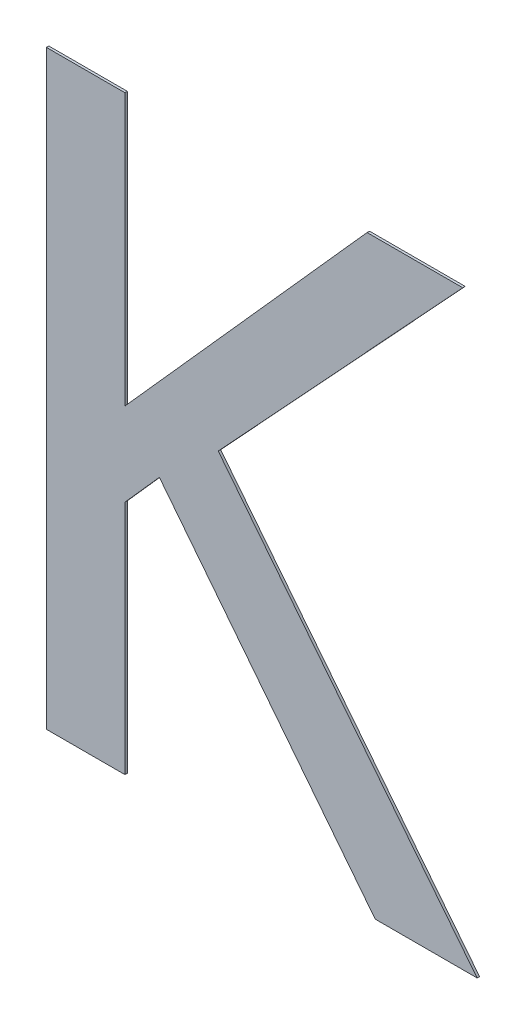
ISO-10303-21;
HEADER;
FILE_DESCRIPTION(('STEP AP214'),'2;1');
FILE_NAME('part.step','',(''),(''),'','','');
FILE_SCHEMA(('AUTOMOTIVE_DESIGN { 1 0 10303 214 1 1 1 1 }'));
ENDSEC;
DATA;
#1=APPLICATION_CONTEXT('core data for automotive mechanical design processes');
#2=APPLICATION_PROTOCOL_DEFINITION('international standard','automotive_design',2000,#1);
#3=PRODUCT_CONTEXT('',#1,'mechanical');
#4=PRODUCT('Part','Part','',(#3));
#5=PRODUCT_RELATED_PRODUCT_CATEGORY('part','',(#4));
#6=PRODUCT_DEFINITION_FORMATION('','',#4);
#7=PRODUCT_DEFINITION_CONTEXT('part definition',#1,'design');
#8=PRODUCT_DEFINITION('design','',#6,#7);
#9=PRODUCT_DEFINITION_SHAPE('','',#8);
#10=(LENGTH_UNIT() NAMED_UNIT(*) SI_UNIT(.MILLI.,.METRE.));
#11=(NAMED_UNIT(*) PLANE_ANGLE_UNIT() SI_UNIT($,.RADIAN.));
#12=(NAMED_UNIT(*) SI_UNIT($,.STERADIAN.) SOLID_ANGLE_UNIT());
#13=UNCERTAINTY_MEASURE_WITH_UNIT(LENGTH_MEASURE(1.E-05),#10,'distance_accuracy_value','');
#14=(GEOMETRIC_REPRESENTATION_CONTEXT(3) GLOBAL_UNCERTAINTY_ASSIGNED_CONTEXT((#13)) GLOBAL_UNIT_ASSIGNED_CONTEXT((#10,
#11,#12)) REPRESENTATION_CONTEXT('',''));
#15=CARTESIAN_POINT('',(0.,0.,0.));
#16=DIRECTION('',(0.,0.,1.));
#17=DIRECTION('',(1.,0.,0.));
#18=AXIS2_PLACEMENT_3D('',#15,#16,#17);
#19=CARTESIAN_POINT('',(-0.0746386260347803,-1.09910590058634,0.));
#20=DIRECTION('',(-0.786318338822423,-0.617821551931904,0.));
#21=DIRECTION('',(0.617821551931904,-0.786318338822423,0.));
#22=AXIS2_PLACEMENT_3D('',#19,#20,#21);
#23=PLANE('',#22);
#24=DIRECTION('',(-0.617821551931903,0.786318338822423,0.));
#25=VECTOR('',#24,1.);
#26=CARTESIAN_POINT('',(0.104445648049852,-1.32703134033042,0.));
#27=LINE('',#26,#25);
#28=CARTESIAN_POINT('',(0.104445648049852,-1.32703134033042,0.));
#29=VERTEX_POINT('',#28);
#30=CARTESIAN_POINT('',(-0.0746386260347803,-1.09910590058634,0.));
#31=VERTEX_POINT('',#30);
#32=EDGE_CURVE('E11',#29,#31,#27,.T.);
#33=ORIENTED_EDGE('',*,*,#32,.F.);
#34=DIRECTION('',(0.,0.,1.));
#35=VECTOR('',#34,1.);
#36=CARTESIAN_POINT('',(0.104445648049852,-1.32703134033042,0.));
#37=LINE('',#36,#35);
#38=CARTESIAN_POINT('',(0.104445648049852,-1.32703134033042,0.002));
#39=VERTEX_POINT('',#38);
#40=EDGE_CURVE('E201',#29,#39,#37,.T.);
#41=ORIENTED_EDGE('',*,*,#40,.T.);
#42=DIRECTION('',(0.617821551931903,-0.786318338822423,0.));
#43=VECTOR('',#42,1.);
#44=CARTESIAN_POINT('',(-0.0746386260347816,-1.09910590058634,0.002));
#45=LINE('',#44,#43);
#46=CARTESIAN_POINT('',(-0.0746386260347803,-1.09910590058634,0.002));
#47=VERTEX_POINT('',#46);
#48=EDGE_CURVE('E127',#47,#39,#45,.T.);
#49=ORIENTED_EDGE('',*,*,#48,.F.);
#50=DIRECTION('',(0.,0.,1.));
#51=VECTOR('',#50,1.);
#52=CARTESIAN_POINT('',(-0.0746386260347803,-1.09910590058634,0.));
#53=LINE('',#52,#51);
#54=EDGE_CURVE('E196',#31,#47,#53,.T.);
#55=ORIENTED_EDGE('',*,*,#54,.F.);
#56=EDGE_LOOP('',(#33,#41,#49,#55));
#57=FACE_BOUND('',#56,.T.);
#58=ADVANCED_FACE('F17',(#57),#23,.T.);
#59=CARTESIAN_POINT('',(-0.103228576664699,-1.131269595045,0.));
#60=DIRECTION('',(0.747409318683659,-0.664363838829921,0.));
#61=DIRECTION('',(0.664363838829921,0.747409318683659,0.));
#62=AXIS2_PLACEMENT_3D('',#59,#60,#61);
#63=PLANE('',#62);
#64=DIRECTION('',(-0.664363838829923,-0.747409318683657,0.));
#65=VECTOR('',#64,1.);
#66=CARTESIAN_POINT('',(-0.0746386260347803,-1.09910590058634,0.));
#67=LINE('',#66,#65);
#68=CARTESIAN_POINT('',(-0.103228576664699,-1.131269595045,0.));
#69=VERTEX_POINT('',#68);
#70=EDGE_CURVE('E24',#31,#69,#67,.T.);
#71=ORIENTED_EDGE('',*,*,#70,.F.);
#72=ORIENTED_EDGE('',*,*,#54,.T.);
#73=DIRECTION('',(0.664363838829923,0.747409318683657,0.));
#74=VECTOR('',#73,1.);
#75=CARTESIAN_POINT('',(-0.1032285766647,-1.131269595045,0.002));
#76=LINE('',#75,#74);
#77=CARTESIAN_POINT('',(-0.103228576664699,-1.131269595045,0.002));
#78=VERTEX_POINT('',#77);
#79=EDGE_CURVE('E188',#78,#47,#76,.T.);
#80=ORIENTED_EDGE('',*,*,#79,.F.);
#81=DIRECTION('',(0.,0.,1.));
#82=VECTOR('',#81,1.);
#83=CARTESIAN_POINT('',(-0.103228576664699,-1.131269595045,0.));
#84=LINE('',#83,#82);
#85=EDGE_CURVE('E190',#69,#78,#84,.T.);
#86=ORIENTED_EDGE('',*,*,#85,.F.);
#87=EDGE_LOOP('',(#71,#72,#80,#86));
#88=FACE_BOUND('',#87,.T.);
#89=ADVANCED_FACE('F206',(#88),#63,.T.);
#90=CARTESIAN_POINT('',(-0.103228576664699,-1.32703134033042,0.));
#91=DIRECTION('',(1.,0.,0.));
#92=DIRECTION('',(0.,1.,0.));
#93=AXIS2_PLACEMENT_3D('',#90,#91,#92);
#94=PLANE('',#93);
#95=DIRECTION('',(0.,-1.,0.));
#96=VECTOR('',#95,1.);
#97=CARTESIAN_POINT('',(-0.103228576664699,-1.131269595045,0.));
#98=LINE('',#97,#96);
#99=CARTESIAN_POINT('',(-0.103228576664699,-1.32703134033042,0.));
#100=VERTEX_POINT('',#99);
#101=EDGE_CURVE('E198',#69,#100,#98,.T.);
#102=ORIENTED_EDGE('',*,*,#101,.F.);
#103=ORIENTED_EDGE('',*,*,#85,.T.);
#104=DIRECTION('',(0.,1.,0.));
#105=VECTOR('',#104,1.);
#106=CARTESIAN_POINT('',(-0.103228576664699,-1.32703134033042,0.002));
#107=LINE('',#106,#105);
#108=CARTESIAN_POINT('',(-0.103228576664699,-1.32703134033042,0.002));
#109=VERTEX_POINT('',#108);
#110=EDGE_CURVE('E180',#109,#78,#107,.T.);
#111=ORIENTED_EDGE('',*,*,#110,.F.);
#112=DIRECTION('',(0.,0.,1.));
#113=VECTOR('',#112,1.);
#114=CARTESIAN_POINT('',(-0.103228576664699,-1.32703134033042,0.));
#115=LINE('',#114,#113);
#116=EDGE_CURVE('E183',#100,#109,#115,.T.);
#117=ORIENTED_EDGE('',*,*,#116,.F.);
#118=EDGE_LOOP('',(#102,#103,#111,#117));
#119=FACE_BOUND('',#118,.T.);
#120=ADVANCED_FACE('F208',(#119),#94,.T.);
#121=CARTESIAN_POINT('',(-0.168350130877293,-1.32703134033042,0.));
#122=DIRECTION('',(0.,-1.,0.));
#123=DIRECTION('',(1.,0.,0.));
#124=AXIS2_PLACEMENT_3D('',#121,#122,#123);
#125=PLANE('',#124);
#126=DIRECTION('',(-1.,0.,0.));
#127=VECTOR('',#126,1.);
#128=CARTESIAN_POINT('',(-0.103228576664699,-1.32703134033042,0.));
#129=LINE('',#128,#127);
#130=CARTESIAN_POINT('',(-0.168350130877293,-1.32703134033042,0.));
#131=VERTEX_POINT('',#130);
#132=EDGE_CURVE('E192',#100,#131,#129,.T.);
#133=ORIENTED_EDGE('',*,*,#132,.F.);
#134=ORIENTED_EDGE('',*,*,#116,.T.);
#135=DIRECTION('',(1.,0.,0.));
#136=VECTOR('',#135,1.);
#137=CARTESIAN_POINT('',(-0.168350130877293,-1.32703134033042,0.002));
#138=LINE('',#137,#136);
#139=CARTESIAN_POINT('',(-0.168350130877293,-1.32703134033042,0.002));
#140=VERTEX_POINT('',#139);
#141=EDGE_CURVE('E172',#140,#109,#138,.T.);
#142=ORIENTED_EDGE('',*,*,#141,.F.);
#143=DIRECTION('',(0.,0.,1.));
#144=VECTOR('',#143,1.);
#145=CARTESIAN_POINT('',(-0.168350130877293,-1.32703134033042,0.));
#146=LINE('',#145,#144);
#147=EDGE_CURVE('E175',#131,#140,#146,.T.);
#148=ORIENTED_EDGE('',*,*,#147,.F.);
#149=EDGE_LOOP('',(#133,#134,#142,#148));
#150=FACE_BOUND('',#149,.T.);
#151=ADVANCED_FACE('F212',(#150),#125,.T.);
#152=CARTESIAN_POINT('',(-0.168350130877293,-0.837031353145417,0.));
#153=DIRECTION('',(-1.,0.,0.));
#154=DIRECTION('',(0.,-1.,0.));
#155=AXIS2_PLACEMENT_3D('',#152,#153,#154);
#156=PLANE('',#155);
#157=DIRECTION('',(0.,1.,0.));
#158=VECTOR('',#157,1.);
#159=CARTESIAN_POINT('',(-0.168350130877293,-1.32703134033042,0.));
#160=LINE('',#159,#158);
#161=CARTESIAN_POINT('',(-0.168350130877293,-0.837031353145417,0.));
#162=VERTEX_POINT('',#161);
#163=EDGE_CURVE('E185',#131,#162,#160,.T.);
#164=ORIENTED_EDGE('',*,*,#163,.F.);
#165=ORIENTED_EDGE('',*,*,#147,.T.);
#166=DIRECTION('',(0.,-1.,0.));
#167=VECTOR('',#166,1.);
#168=CARTESIAN_POINT('',(-0.168350130877293,-0.837031353145417,0.002));
#169=LINE('',#168,#167);
#170=CARTESIAN_POINT('',(-0.168350130877293,-0.837031353145417,0.002));
#171=VERTEX_POINT('',#170);
#172=EDGE_CURVE('E164',#171,#140,#169,.T.);
#173=ORIENTED_EDGE('',*,*,#172,.F.);
#174=DIRECTION('',(0.,0.,1.));
#175=VECTOR('',#174,1.);
#176=CARTESIAN_POINT('',(-0.168350130877293,-0.837031353145417,0.));
#177=LINE('',#176,#175);
#178=EDGE_CURVE('E167',#162,#171,#177,.T.);
#179=ORIENTED_EDGE('',*,*,#178,.F.);
#180=EDGE_LOOP('',(#164,#165,#173,#179));
#181=FACE_BOUND('',#180,.T.);
#182=ADVANCED_FACE('F216',(#181),#156,.T.);
#183=CARTESIAN_POINT('',(-0.103228576664699,-0.837031353145417,0.));
#184=DIRECTION('',(0.,1.,0.));
#185=DIRECTION('',(-1.,0.,0.));
#186=AXIS2_PLACEMENT_3D('',#183,#184,#185);
#187=PLANE('',#186);
#188=DIRECTION('',(1.,0.,0.));
#189=VECTOR('',#188,1.);
#190=CARTESIAN_POINT('',(-0.168350130877293,-0.837031353145417,0.));
#191=LINE('',#190,#189);
#192=CARTESIAN_POINT('',(-0.103228576664699,-0.837031353145417,0.));
#193=VERTEX_POINT('',#192);
#194=EDGE_CURVE('E177',#162,#193,#191,.T.);
#195=ORIENTED_EDGE('',*,*,#194,.F.);
#196=ORIENTED_EDGE('',*,*,#178,.T.);
#197=DIRECTION('',(-1.,0.,0.));
#198=VECTOR('',#197,1.);
#199=CARTESIAN_POINT('',(-0.103228576664699,-0.837031353145417,0.002));
#200=LINE('',#199,#198);
#201=CARTESIAN_POINT('',(-0.103228576664699,-0.837031353145417,0.002));
#202=VERTEX_POINT('',#201);
#203=EDGE_CURVE('E156',#202,#171,#200,.T.);
#204=ORIENTED_EDGE('',*,*,#203,.F.);
#205=DIRECTION('',(0.,0.,1.));
#206=VECTOR('',#205,1.);
#207=CARTESIAN_POINT('',(-0.103228576664699,-0.837031353145417,0.));
#208=LINE('',#207,#206);
#209=EDGE_CURVE('E159',#193,#202,#208,.T.);
#210=ORIENTED_EDGE('',*,*,#209,.F.);
#211=EDGE_LOOP('',(#195,#196,#204,#210));
#212=FACE_BOUND('',#211,.T.);
#213=ADVANCED_FACE('F220',(#212),#187,.T.);
#214=CARTESIAN_POINT('',(-0.103228576664699,-1.06217721435603,0.));
#215=DIRECTION('',(1.,0.,0.));
#216=DIRECTION('',(0.,1.,0.));
#217=AXIS2_PLACEMENT_3D('',#214,#215,#216);
#218=PLANE('',#217);
#219=DIRECTION('',(0.,-1.,0.));
#220=VECTOR('',#219,1.);
#221=CARTESIAN_POINT('',(-0.103228576664699,-0.837031353145417,0.));
#222=LINE('',#221,#220);
#223=CARTESIAN_POINT('',(-0.103228576664699,-1.06217721435603,0.));
#224=VERTEX_POINT('',#223);
#225=EDGE_CURVE('E169',#193,#224,#222,.T.);
#226=ORIENTED_EDGE('',*,*,#225,.F.);
#227=ORIENTED_EDGE('',*,*,#209,.T.);
#228=DIRECTION('',(0.,1.,0.));
#229=VECTOR('',#228,1.);
#230=CARTESIAN_POINT('',(-0.103228576664699,-1.06217721435603,0.002));
#231=LINE('',#230,#229);
#232=CARTESIAN_POINT('',(-0.103228576664699,-1.06217721435603,0.002));
#233=VERTEX_POINT('',#232);
#234=EDGE_CURVE('E148',#233,#202,#231,.T.);
#235=ORIENTED_EDGE('',*,*,#234,.F.);
#236=DIRECTION('',(0.,0.,1.));
#237=VECTOR('',#236,1.);
#238=CARTESIAN_POINT('',(-0.103228576664699,-1.06217721435603,0.));
#239=LINE('',#238,#237);
#240=EDGE_CURVE('E151',#224,#233,#239,.T.);
#241=ORIENTED_EDGE('',*,*,#240,.F.);
#242=EDGE_LOOP('',(#226,#227,#235,#241));
#243=FACE_BOUND('',#242,.T.);
#244=ADVANCED_FACE('F224',(#243),#218,.T.);
#245=CARTESIAN_POINT('',(0.0976952430400095,-0.837031353145417,0.));
#246=DIRECTION('',(-0.746101072885279,0.665832703491977,0.));
#247=DIRECTION('',(-0.665832703491977,-0.746101072885279,0.));
#248=AXIS2_PLACEMENT_3D('',#245,#246,#247);
#249=PLANE('',#248);
#250=DIRECTION('',(0.665832703491977,0.746101072885279,0.));
#251=VECTOR('',#250,1.);
#252=CARTESIAN_POINT('',(-0.103228576664699,-1.06217721435603,0.));
#253=LINE('',#252,#251);
#254=CARTESIAN_POINT('',(0.0976952430400095,-0.837031353145417,0.));
#255=VERTEX_POINT('',#254);
#256=EDGE_CURVE('E161',#224,#255,#253,.T.);
#257=ORIENTED_EDGE('',*,*,#256,.F.);
#258=ORIENTED_EDGE('',*,*,#240,.T.);
#259=DIRECTION('',(-0.665832703491977,-0.74610107288528,0.));
#260=VECTOR('',#259,1.);
#261=CARTESIAN_POINT('',(0.0976952430400098,-0.837031353145417,0.002));
#262=LINE('',#261,#260);
#263=CARTESIAN_POINT('',(0.0976952430400095,-0.837031353145417,0.002));
#264=VERTEX_POINT('',#263);
#265=EDGE_CURVE('E140',#264,#233,#262,.T.);
#266=ORIENTED_EDGE('',*,*,#265,.F.);
#267=DIRECTION('',(0.,0.,1.));
#268=VECTOR('',#267,1.);
#269=CARTESIAN_POINT('',(0.0976952430400095,-0.837031353145417,0.));
#270=LINE('',#269,#268);
#271=EDGE_CURVE('E143',#255,#264,#270,.T.);
#272=ORIENTED_EDGE('',*,*,#271,.F.);
#273=EDGE_LOOP('',(#257,#258,#266,#272));
#274=FACE_BOUND('',#273,.T.);
#275=ADVANCED_FACE('F228',(#274),#249,.T.);
#276=CARTESIAN_POINT('',(0.177111772567562,-0.837031353145417,0.));
#277=DIRECTION('',(0.,1.,0.));
#278=DIRECTION('',(-1.,0.,0.));
#279=AXIS2_PLACEMENT_3D('',#276,#277,#278);
#280=PLANE('',#279);
#281=DIRECTION('',(1.,0.,0.));
#282=VECTOR('',#281,1.);
#283=CARTESIAN_POINT('',(0.0976952430400095,-0.837031353145417,0.));
#284=LINE('',#283,#282);
#285=CARTESIAN_POINT('',(0.177111772567562,-0.837031353145417,0.));
#286=VERTEX_POINT('',#285);
#287=EDGE_CURVE('E153',#255,#286,#284,.T.);
#288=ORIENTED_EDGE('',*,*,#287,.F.);
#289=ORIENTED_EDGE('',*,*,#271,.T.);
#290=DIRECTION('',(-1.,0.,0.));
#291=VECTOR('',#290,1.);
#292=CARTESIAN_POINT('',(0.177111772567562,-0.837031353145417,0.002));
#293=LINE('',#292,#291);
#294=CARTESIAN_POINT('',(0.177111772567562,-0.837031353145417,0.002));
#295=VERTEX_POINT('',#294);
#296=EDGE_CURVE('E133',#295,#264,#293,.T.);
#297=ORIENTED_EDGE('',*,*,#296,.F.);
#298=DIRECTION('',(0.,0.,1.));
#299=VECTOR('',#298,1.);
#300=CARTESIAN_POINT('',(0.177111772567562,-0.837031353145417,0.));
#301=LINE('',#300,#299);
#302=EDGE_CURVE('E136',#286,#295,#301,.T.);
#303=ORIENTED_EDGE('',*,*,#302,.F.);
#304=EDGE_LOOP('',(#288,#289,#297,#303));
#305=FACE_BOUND('',#304,.T.);
#306=ADVANCED_FACE('F232',(#305),#280,.T.);
#307=CARTESIAN_POINT('',(-0.0257974603753352,-1.05582389199382,0.));
#308=DIRECTION('',(0.73321990323995,-0.679991598104563,0.));
#309=DIRECTION('',(0.679991598104563,0.73321990323995,0.));
#310=AXIS2_PLACEMENT_3D('',#307,#308,#309);
#311=PLANE('',#310);
#312=DIRECTION('',(-0.679991598104564,-0.73321990323995,0.));
#313=VECTOR('',#312,1.);
#314=CARTESIAN_POINT('',(0.177111772567562,-0.837031353145417,0.));
#315=LINE('',#314,#313);
#316=CARTESIAN_POINT('',(-0.0257974603753352,-1.05582389199382,0.));
#317=VERTEX_POINT('',#316);
#318=EDGE_CURVE('E145',#286,#317,#315,.T.);
#319=ORIENTED_EDGE('',*,*,#318,.F.);
#320=ORIENTED_EDGE('',*,*,#302,.T.);
#321=DIRECTION('',(0.679991598104563,0.73321990323995,0.));
#322=VECTOR('',#321,1.);
#323=CARTESIAN_POINT('',(-0.0257974603753328,-1.05582389199382,0.002));
#324=LINE('',#323,#322);
#325=CARTESIAN_POINT('',(-0.0257974603753352,-1.05582389199382,0.002));
#326=VERTEX_POINT('',#325);
#327=EDGE_CURVE('E113',#326,#295,#324,.T.);
#328=ORIENTED_EDGE('',*,*,#327,.F.);
#329=DIRECTION('',(0.,0.,1.));
#330=VECTOR('',#329,1.);
#331=CARTESIAN_POINT('',(-0.0257974603753352,-1.05582389199382,0.));
#332=LINE('',#331,#330);
#333=EDGE_CURVE('E119',#317,#326,#332,.T.);
#334=ORIENTED_EDGE('',*,*,#333,.F.);
#335=EDGE_LOOP('',(#319,#320,#328,#334));
#336=FACE_BOUND('',#335,.T.);
#337=ADVANCED_FACE('F235',(#336),#311,.T.);
#338=CARTESIAN_POINT('',(0.189024251996695,-1.32703134033042,0.));
#339=DIRECTION('',(0.783882889412984,0.620908701570168,0.));
#340=DIRECTION('',(-0.620908701570168,0.783882889412984,0.));
#341=AXIS2_PLACEMENT_3D('',#338,#339,#340);
#342=PLANE('',#341);
#343=DIRECTION('',(0.620908701570168,-0.783882889412984,0.));
#344=VECTOR('',#343,1.);
#345=CARTESIAN_POINT('',(-0.0257974603753352,-1.05582389199382,0.));
#346=LINE('',#345,#344);
#347=CARTESIAN_POINT('',(0.189024251996695,-1.32703134033042,0.));
#348=VERTEX_POINT('',#347);
#349=EDGE_CURVE('E138',#317,#348,#346,.T.);
#350=ORIENTED_EDGE('',*,*,#349,.F.);
#351=ORIENTED_EDGE('',*,*,#333,.T.);
#352=DIRECTION('',(-0.620908701570168,0.783882889412984,0.));
#353=VECTOR('',#352,1.);
#354=CARTESIAN_POINT('',(0.189024251996699,-1.32703134033042,0.002));
#355=LINE('',#354,#353);
#356=CARTESIAN_POINT('',(0.189024251996695,-1.32703134033042,0.002));
#357=VERTEX_POINT('',#356);
#358=EDGE_CURVE('E114',#357,#326,#355,.T.);
#359=ORIENTED_EDGE('',*,*,#358,.F.);
#360=DIRECTION('',(0.,0.,1.));
#361=VECTOR('',#360,1.);
#362=CARTESIAN_POINT('',(0.189024251996695,-1.32703134033042,0.));
#363=LINE('',#362,#361);
#364=EDGE_CURVE('E103',#348,#357,#363,.T.);
#365=ORIENTED_EDGE('',*,*,#364,.F.);
#366=EDGE_LOOP('',(#350,#351,#359,#365));
#367=FACE_BOUND('',#366,.T.);
#368=ADVANCED_FACE('F117',(#367),#342,.T.);
#369=CARTESIAN_POINT('',(0.104445648049852,-1.32703134033042,0.));
#370=DIRECTION('',(0.,-1.,0.));
#371=DIRECTION('',(1.,0.,0.));
#372=AXIS2_PLACEMENT_3D('',#369,#370,#371);
#373=PLANE('',#372);
#374=DIRECTION('',(-1.,0.,0.));
#375=VECTOR('',#374,1.);
#376=CARTESIAN_POINT('',(0.189024251996695,-1.32703134033042,0.));
#377=LINE('',#376,#375);
#378=EDGE_CURVE('E110',#348,#29,#377,.T.);
#379=ORIENTED_EDGE('',*,*,#378,.F.);
#380=ORIENTED_EDGE('',*,*,#364,.T.);
#381=DIRECTION('',(1.,0.,0.));
#382=VECTOR('',#381,1.);
#383=CARTESIAN_POINT('',(0.104445648049852,-1.32703134033042,0.002));
#384=LINE('',#383,#382);
#385=EDGE_CURVE('E108',#39,#357,#384,.T.);
#386=ORIENTED_EDGE('',*,*,#385,.F.);
#387=ORIENTED_EDGE('',*,*,#40,.F.);
#388=EDGE_LOOP('',(#379,#380,#386,#387));
#389=FACE_BOUND('',#388,.T.);
#390=ADVANCED_FACE('F105',(#389),#373,.T.);
#391=CARTESIAN_POINT('',(-0.0281112297960724,-1.08085695455521,0.));
#392=DIRECTION('',(0.,0.,1.));
#393=DIRECTION('',(1.,0.,0.));
#394=AXIS2_PLACEMENT_3D('',#391,#392,#393);
#395=PLANE('',#394);
#396=ORIENTED_EDGE('',*,*,#378,.T.);
#397=ORIENTED_EDGE('',*,*,#32,.T.);
#398=ORIENTED_EDGE('',*,*,#70,.T.);
#399=ORIENTED_EDGE('',*,*,#101,.T.);
#400=ORIENTED_EDGE('',*,*,#132,.T.);
#401=ORIENTED_EDGE('',*,*,#163,.T.);
#402=ORIENTED_EDGE('',*,*,#194,.T.);
#403=ORIENTED_EDGE('',*,*,#225,.T.);
#404=ORIENTED_EDGE('',*,*,#256,.T.);
#405=ORIENTED_EDGE('',*,*,#287,.T.);
#406=ORIENTED_EDGE('',*,*,#318,.T.);
#407=ORIENTED_EDGE('',*,*,#349,.T.);
#408=EDGE_LOOP('',(#396,#397,#398,#399,#400,#401,#402,#403,#404,#405,#406,#407));
#409=FACE_BOUND('',#408,.T.);
#410=ADVANCED_FACE('F203',(#409),#395,.F.);
#411=CARTESIAN_POINT('',(-0.0281112297960724,-1.08085695455521,0.002));
#412=DIRECTION('',(0.,0.,1.));
#413=DIRECTION('',(1.,0.,0.));
#414=AXIS2_PLACEMENT_3D('',#411,#412,#413);
#415=PLANE('',#414);
#416=ORIENTED_EDGE('',*,*,#385,.T.);
#417=ORIENTED_EDGE('',*,*,#358,.T.);
#418=ORIENTED_EDGE('',*,*,#327,.T.);
#419=ORIENTED_EDGE('',*,*,#296,.T.);
#420=ORIENTED_EDGE('',*,*,#265,.T.);
#421=ORIENTED_EDGE('',*,*,#234,.T.);
#422=ORIENTED_EDGE('',*,*,#203,.T.);
#423=ORIENTED_EDGE('',*,*,#172,.T.);
#424=ORIENTED_EDGE('',*,*,#141,.T.);
#425=ORIENTED_EDGE('',*,*,#110,.T.);
#426=ORIENTED_EDGE('',*,*,#79,.T.);
#427=ORIENTED_EDGE('',*,*,#48,.T.);
#428=EDGE_LOOP('',(#416,#417,#418,#419,#420,#421,#422,#423,#424,#425,#426,#427));
#429=FACE_BOUND('',#428,.T.);
#430=ADVANCED_FACE('F124',(#429),#415,.T.);
#431=CLOSED_SHELL('',(#58,#89,#120,#151,#182,#213,#244,#275,#306,#337,#368,#390,#410,#430));
#432=MANIFOLD_SOLID_BREP('B1',#431);
#433=ADVANCED_BREP_SHAPE_REPRESENTATION('',(#18,#432),#14);
#434=SHAPE_DEFINITION_REPRESENTATION(#9,#433);
ENDSEC;
END-ISO-10303-21;
